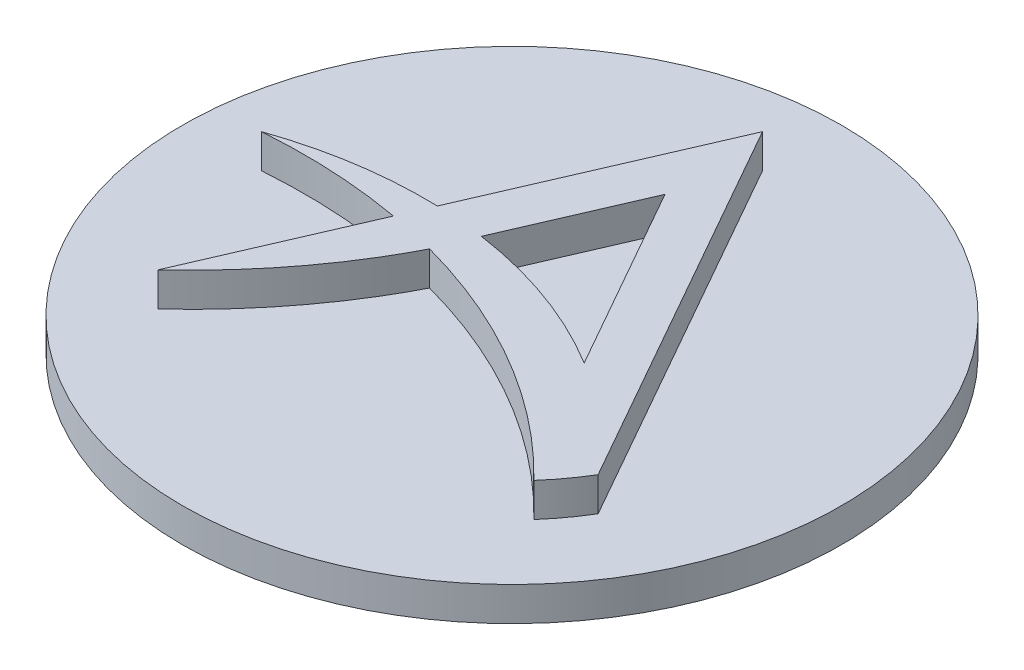
ISO-10303-21;
HEADER;
FILE_DESCRIPTION(('STEP AP214'),'2;1');
FILE_NAME('part.step','',(''),(''),'','','');
FILE_SCHEMA(('AUTOMOTIVE_DESIGN { 1 0 10303 214 1 1 1 1 }'));
ENDSEC;
DATA;
#1=APPLICATION_CONTEXT('core data for automotive mechanical design processes');
#2=APPLICATION_PROTOCOL_DEFINITION('international standard','automotive_design',2000,#1);
#3=PRODUCT_CONTEXT('',#1,'mechanical');
#4=PRODUCT('Part','Part','',(#3));
#5=PRODUCT_RELATED_PRODUCT_CATEGORY('part','',(#4));
#6=PRODUCT_DEFINITION_FORMATION('','',#4);
#7=PRODUCT_DEFINITION_CONTEXT('part definition',#1,'design');
#8=PRODUCT_DEFINITION('design','',#6,#7);
#9=PRODUCT_DEFINITION_SHAPE('','',#8);
#10=(LENGTH_UNIT() NAMED_UNIT(*) SI_UNIT(.MILLI.,.METRE.));
#11=(NAMED_UNIT(*) PLANE_ANGLE_UNIT() SI_UNIT($,.RADIAN.));
#12=(NAMED_UNIT(*) SI_UNIT($,.STERADIAN.) SOLID_ANGLE_UNIT());
#13=UNCERTAINTY_MEASURE_WITH_UNIT(LENGTH_MEASURE(1.E-05),#10,'distance_accuracy_value','');
#14=(GEOMETRIC_REPRESENTATION_CONTEXT(3) GLOBAL_UNCERTAINTY_ASSIGNED_CONTEXT((#13)) GLOBAL_UNIT_ASSIGNED_CONTEXT((#10,
#11,#12)) REPRESENTATION_CONTEXT('',''));
#15=CARTESIAN_POINT('',(0.,0.,0.));
#16=DIRECTION('',(0.,0.,1.));
#17=DIRECTION('',(1.,0.,0.));
#18=AXIS2_PLACEMENT_3D('',#15,#16,#17);
#19=CARTESIAN_POINT('',(0.,2.5,0.));
#20=DIRECTION('',(0.,-1.,0.));
#21=DIRECTION('',(0.,0.,-1.));
#22=AXIS2_PLACEMENT_3D('',#19,#20,#21);
#23=CYLINDRICAL_SURFACE('',#22,24.3);
#24=CARTESIAN_POINT('',(0.,2.5,0.));
#25=DIRECTION('',(0.,1.,0.));
#26=DIRECTION('',(0.,0.,1.));
#27=AXIS2_PLACEMENT_3D('',#24,#25,#26);
#28=CIRCLE('',#27,24.3);
#29=CARTESIAN_POINT('',(0.,2.5,24.3));
#30=VERTEX_POINT('',#29);
#31=EDGE_CURVE('E11',#30,#30,#28,.T.);
#32=ORIENTED_EDGE('',*,*,#31,.F.);
#33=EDGE_LOOP('',(#32));
#34=FACE_BOUND('',#33,.T.);
#35=CARTESIAN_POINT('',(0.,0.,0.));
#36=DIRECTION('',(0.,1.,0.));
#37=DIRECTION('',(0.,0.,1.));
#38=AXIS2_PLACEMENT_3D('',#35,#36,#37);
#39=CIRCLE('',#38,24.3);
#40=CARTESIAN_POINT('',(0.,0.,24.3));
#41=VERTEX_POINT('',#40);
#42=EDGE_CURVE('E43',#41,#41,#39,.T.);
#43=ORIENTED_EDGE('',*,*,#42,.T.);
#44=EDGE_LOOP('',(#43));
#45=FACE_BOUND('',#44,.T.);
#46=ADVANCED_FACE('F40',(#34,#45),#23,.T.);
#47=CARTESIAN_POINT('',(0.,2.5,0.));
#48=DIRECTION('',(0.,1.,0.));
#49=DIRECTION('',(0.,0.,1.));
#50=AXIS2_PLACEMENT_3D('',#47,#48,#49);
#51=PLANE('',#50);
#52=DIRECTION('',(0.397081863577859,0.,-0.91778319532313));
#53=VECTOR('',#52,1.);
#54=CARTESIAN_POINT('',(-6.73065681269044,2.5,-2.9120404076969));
#55=LINE('',#54,#53);
#56=CARTESIAN_POINT('',(-13.4613136253809,2.5,12.6446603202456));
#57=VERTEX_POINT('',#56);
#58=CARTESIAN_POINT('',(-8.21708849437097,2.5,0.523578651179607));
#59=VERTEX_POINT('',#58);
#60=EDGE_CURVE('E216',#57,#59,#55,.T.);
#61=ORIENTED_EDGE('',*,*,#60,.T.);
#62=CARTESIAN_POINT('',(-15.4090407134637,2.5,40.7164659561309));
#63=DIRECTION('',(0.,1.,0.));
#64=DIRECTION('',(0.,0.,1.));
#65=AXIS2_PLACEMENT_3D('',#62,#63,#64);
#66=CIRCLE('',#65,40.8312670221024);
#67=CARTESIAN_POINT('',(-18.4687411356394,2.5,0.));
#68=VERTEX_POINT('',#67);
#69=EDGE_CURVE('E142',#68,#59,#66,.F.);
#70=ORIENTED_EDGE('',*,*,#69,.F.);
#71=CARTESIAN_POINT('',(-8.16544651984489,2.5,29.5139268269388));
#72=DIRECTION('',(0.,1.,0.));
#73=DIRECTION('',(0.,0.,1.));
#74=AXIS2_PLACEMENT_3D('',#71,#72,#73);
#75=CIRCLE('',#74,31.2606742839267);
#76=CARTESIAN_POINT('',(-7.24074307061564,2.5,-1.73306791202355));
#77=VERTEX_POINT('',#76);
#78=EDGE_CURVE('E145',#68,#77,#75,.F.);
#79=ORIENTED_EDGE('',*,*,#78,.T.);
#80=DIRECTION('',(0.397081863577859,0.,-0.91778319532313));
#81=VECTOR('',#80,1.);
#82=CARTESIAN_POINT('',(-6.73065681269044,2.5,-2.9120404076969));
#83=LINE('',#82,#81);
#84=CARTESIAN_POINT('',(0.,2.5,-18.4687411356394));
#85=VERTEX_POINT('',#84);
#86=EDGE_CURVE('E239',#77,#85,#83,.T.);
#87=ORIENTED_EDGE('',*,*,#86,.T.);
#88=DIRECTION('',(0.492957258861656,0.,0.870053527626664));
#89=VECTOR('',#88,1.);
#90=CARTESIAN_POINT('',(7.92122833579145,2.5,-4.48803077424516));
#91=LINE('',#90,#89);
#92=CARTESIAN_POINT('',(15.8424566715829,2.5,9.49267958714904));
#93=VERTEX_POINT('',#92);
#94=EDGE_CURVE('E236',#85,#93,#91,.T.);
#95=ORIENTED_EDGE('',*,*,#94,.T.);
#96=CARTESIAN_POINT('',(0.,2.5,0.));
#97=DIRECTION('',(0.,1.,0.));
#98=DIRECTION('',(0.,0.,1.));
#99=AXIS2_PLACEMENT_3D('',#96,#97,#98);
#100=CIRCLE('',#99,18.4687411356394);
#101=CARTESIAN_POINT('',(13.8412285896734,2.5,12.2276240645379));
#102=VERTEX_POINT('',#101);
#103=EDGE_CURVE('E233',#102,#93,#100,.T.);
#104=ORIENTED_EDGE('',*,*,#103,.F.);
#105=CARTESIAN_POINT('',(-15.4090407134637,2.5,40.7164659561309));
#106=DIRECTION('',(0.,1.,0.));
#107=DIRECTION('',(0.,0.,1.));
#108=AXIS2_PLACEMENT_3D('',#105,#106,#107);
#109=CIRCLE('',#108,40.8312670221024);
#110=CARTESIAN_POINT('',(-4.78637451561878,2.5,1.29120337641698));
#111=VERTEX_POINT('',#110);
#112=EDGE_CURVE('E227',#111,#102,#109,.F.);
#113=ORIENTED_EDGE('',*,*,#112,.F.);
#114=CARTESIAN_POINT('',(-13.4613136253809,2.5,12.6446603202456));
#115=CARTESIAN_POINT('',(-8.02790284611201,2.5,7.60307610644724));
#116=CARTESIAN_POINT('',(-4.78637451561878,2.5,1.29120337641698));
#117=B_SPLINE_CURVE_WITH_KNOTS('',2,(#114,#115,#116),.UNSPECIFIED.,.F.,.F.,(3,3),(0.,
0.698779305768103),.UNSPECIFIED.);
#118=EDGE_CURVE('E223',#57,#111,#117,.T.);
#119=ORIENTED_EDGE('',*,*,#118,.F.);
#120=EDGE_LOOP('',(#61,#70,#79,#87,#95,#104,#113,#119));
#121=FACE_BOUND('',#120,.T.);
#122=ORIENTED_EDGE('',*,*,#31,.T.);
#123=EDGE_LOOP('',(#122));
#124=FACE_BOUND('',#123,.T.);
#125=ADVANCED_FACE('F186',(#121,#124),#51,.T.);
#126=CARTESIAN_POINT('',(0.,0.,0.));
#127=DIRECTION('',(0.,1.,0.));
#128=DIRECTION('',(0.,0.,1.));
#129=AXIS2_PLACEMENT_3D('',#126,#127,#128);
#130=PLANE('',#129);
#131=ORIENTED_EDGE('',*,*,#42,.F.);
#132=EDGE_LOOP('',(#131));
#133=FACE_BOUND('',#132,.T.);
#134=ADVANCED_FACE('F174',(#133),#130,.F.);
#135=CARTESIAN_POINT('',(-6.73065681269044,5.,-2.9120404076969));
#136=DIRECTION('',(-0.91778319532313,0.,-0.397081863577859));
#137=DIRECTION('',(-0.397081863577859,0.,0.91778319532313));
#138=AXIS2_PLACEMENT_3D('',#135,#136,#137);
#139=PLANE('',#138);
#140=ORIENTED_EDGE('',*,*,#60,.F.);
#141=DIRECTION('',(0.,-1.,0.));
#142=VECTOR('',#141,1.);
#143=CARTESIAN_POINT('',(-13.4613136253809,5.,12.6446603202456));
#144=LINE('',#143,#142);
#145=CARTESIAN_POINT('',(-13.4613136253809,5.,12.6446603202456));
#146=VERTEX_POINT('',#145);
#147=EDGE_CURVE('E202',#146,#57,#144,.T.);
#148=ORIENTED_EDGE('',*,*,#147,.F.);
#149=DIRECTION('',(0.397081863577859,0.,-0.91778319532313));
#150=VECTOR('',#149,1.);
#151=CARTESIAN_POINT('',(-6.73065681269044,5.,-2.9120404076969));
#152=LINE('',#151,#150);
#153=CARTESIAN_POINT('',(-8.21708849437097,5.,0.523578651179607));
#154=VERTEX_POINT('',#153);
#155=EDGE_CURVE('E149',#146,#154,#152,.T.);
#156=ORIENTED_EDGE('',*,*,#155,.T.);
#157=DIRECTION('',(0.,-1.,0.));
#158=VECTOR('',#157,1.);
#159=CARTESIAN_POINT('',(-8.21708849437097,5.,0.523578651179607));
#160=LINE('',#159,#158);
#161=EDGE_CURVE('E130',#154,#59,#160,.T.);
#162=ORIENTED_EDGE('',*,*,#161,.T.);
#163=EDGE_LOOP('',(#140,#148,#156,#162));
#164=FACE_BOUND('',#163,.T.);
#165=ADVANCED_FACE('F169',(#164),#139,.T.);
#166=CARTESIAN_POINT('',(-13.4613136253809,5.,12.6446603202456));
#167=CARTESIAN_POINT('',(-8.02790284611201,5.,7.60307610644724));
#168=CARTESIAN_POINT('',(-4.78637451561878,5.,1.29120337641698));
#169=B_SPLINE_CURVE_WITH_KNOTS('',2,(#166,#167,#168),.UNSPECIFIED.,.F.,.F.,(3,3),(0.,
0.698779305768103),.UNSPECIFIED.);
#170=DIRECTION('',(0.,-1.,0.));
#171=VECTOR('',#170,1.);
#172=SURFACE_OF_LINEAR_EXTRUSION('',#169,#171);
#173=ORIENTED_EDGE('',*,*,#118,.T.);
#174=DIRECTION('',(0.,-1.,0.));
#175=VECTOR('',#174,1.);
#176=CARTESIAN_POINT('',(-4.78637451561878,5.,1.29120337641698));
#177=LINE('',#176,#175);
#178=CARTESIAN_POINT('',(-4.78637451561878,5.,1.29120337641698));
#179=VERTEX_POINT('',#178);
#180=EDGE_CURVE('E203',#179,#111,#177,.T.);
#181=ORIENTED_EDGE('',*,*,#180,.F.);
#182=EDGE_CURVE('E152',#146,#179,#169,.T.);
#183=ORIENTED_EDGE('',*,*,#182,.F.);
#184=ORIENTED_EDGE('',*,*,#147,.T.);
#185=EDGE_LOOP('',(#173,#181,#183,#184));
#186=FACE_BOUND('',#185,.T.);
#187=ADVANCED_FACE('F164',(#186),#172,.F.);
#188=CARTESIAN_POINT('',(-15.4090407134637,5.,40.7164659561309));
#189=DIRECTION('',(0.,-1.,0.));
#190=DIRECTION('',(0.,0.,-1.));
#191=AXIS2_PLACEMENT_3D('',#188,#189,#190);
#192=CYLINDRICAL_SURFACE('',#191,40.8312670221024);
#193=ORIENTED_EDGE('',*,*,#112,.T.);
#194=DIRECTION('',(0.,-1.,0.));
#195=VECTOR('',#194,1.);
#196=CARTESIAN_POINT('',(13.8412285896734,5.,12.2276240645379));
#197=LINE('',#196,#195);
#198=CARTESIAN_POINT('',(13.8412285896734,5.,12.2276240645379));
#199=VERTEX_POINT('',#198);
#200=EDGE_CURVE('E208',#199,#102,#197,.T.);
#201=ORIENTED_EDGE('',*,*,#200,.F.);
#202=CARTESIAN_POINT('',(-15.4090407134637,5.,40.7164659561309));
#203=DIRECTION('',(0.,1.,0.));
#204=DIRECTION('',(0.,0.,1.));
#205=AXIS2_PLACEMENT_3D('',#202,#203,#204);
#206=CIRCLE('',#205,40.8312670221024);
#207=EDGE_CURVE('E158',#179,#199,#206,.F.);
#208=ORIENTED_EDGE('',*,*,#207,.F.);
#209=ORIENTED_EDGE('',*,*,#180,.T.);
#210=EDGE_LOOP('',(#193,#201,#208,#209));
#211=FACE_BOUND('',#210,.T.);
#212=ADVANCED_FACE('F168',(#211),#192,.F.);
#213=CARTESIAN_POINT('',(0.,5.,0.));
#214=DIRECTION('',(0.,-1.,0.));
#215=DIRECTION('',(0.,0.,-1.));
#216=AXIS2_PLACEMENT_3D('',#213,#214,#215);
#217=CYLINDRICAL_SURFACE('',#216,18.4687411356394);
#218=ORIENTED_EDGE('',*,*,#103,.T.);
#219=DIRECTION('',(0.,-1.,0.));
#220=VECTOR('',#219,1.);
#221=CARTESIAN_POINT('',(15.8424566715829,5.,9.49267958714904));
#222=LINE('',#221,#220);
#223=CARTESIAN_POINT('',(15.8424566715829,5.,9.49267958714904));
#224=VERTEX_POINT('',#223);
#225=EDGE_CURVE('E252',#224,#93,#222,.T.);
#226=ORIENTED_EDGE('',*,*,#225,.F.);
#227=CARTESIAN_POINT('',(0.,5.,0.));
#228=DIRECTION('',(0.,1.,0.));
#229=DIRECTION('',(0.,0.,1.));
#230=AXIS2_PLACEMENT_3D('',#227,#228,#229);
#231=CIRCLE('',#230,18.4687411356394);
#232=EDGE_CURVE('E258',#199,#224,#231,.T.);
#233=ORIENTED_EDGE('',*,*,#232,.F.);
#234=ORIENTED_EDGE('',*,*,#200,.T.);
#235=EDGE_LOOP('',(#218,#226,#233,#234));
#236=FACE_BOUND('',#235,.T.);
#237=ADVANCED_FACE('F255',(#236),#217,.T.);
#238=CARTESIAN_POINT('',(7.92122833579145,5.,-4.48803077424516));
#239=DIRECTION('',(0.870053527626664,0.,-0.492957258861656));
#240=DIRECTION('',(-0.492957258861656,0.,-0.870053527626664));
#241=AXIS2_PLACEMENT_3D('',#238,#239,#240);
#242=PLANE('',#241);
#243=ORIENTED_EDGE('',*,*,#94,.F.);
#244=DIRECTION('',(0.,-1.,0.));
#245=VECTOR('',#244,1.);
#246=CARTESIAN_POINT('',(0.,5.,-18.4687411356394));
#247=LINE('',#246,#245);
#248=CARTESIAN_POINT('',(0.,5.,-18.4687411356394));
#249=VERTEX_POINT('',#248);
#250=EDGE_CURVE('E250',#249,#85,#247,.T.);
#251=ORIENTED_EDGE('',*,*,#250,.F.);
#252=DIRECTION('',(0.492957258861656,0.,0.870053527626664));
#253=VECTOR('',#252,1.);
#254=CARTESIAN_POINT('',(7.92122833579145,5.,-4.48803077424516));
#255=LINE('',#254,#253);
#256=EDGE_CURVE('E271',#249,#224,#255,.T.);
#257=ORIENTED_EDGE('',*,*,#256,.T.);
#258=ORIENTED_EDGE('',*,*,#225,.T.);
#259=EDGE_LOOP('',(#243,#251,#257,#258));
#260=FACE_BOUND('',#259,.T.);
#261=ADVANCED_FACE('F268',(#260),#242,.T.);
#262=CARTESIAN_POINT('',(-6.73065681269044,5.,-2.9120404076969));
#263=DIRECTION('',(-0.91778319532313,0.,-0.397081863577859));
#264=DIRECTION('',(-0.397081863577859,0.,0.91778319532313));
#265=AXIS2_PLACEMENT_3D('',#262,#263,#264);
#266=PLANE('',#265);
#267=ORIENTED_EDGE('',*,*,#86,.F.);
#268=DIRECTION('',(0.,-1.,0.));
#269=VECTOR('',#268,1.);
#270=CARTESIAN_POINT('',(-7.24074307061564,5.,-1.73306791202355));
#271=LINE('',#270,#269);
#272=CARTESIAN_POINT('',(-7.24074307061564,5.,-1.73306791202355));
#273=VERTEX_POINT('',#272);
#274=EDGE_CURVE('E248',#273,#77,#271,.T.);
#275=ORIENTED_EDGE('',*,*,#274,.F.);
#276=DIRECTION('',(0.397081863577859,0.,-0.91778319532313));
#277=VECTOR('',#276,1.);
#278=CARTESIAN_POINT('',(-6.73065681269044,5.,-2.9120404076969));
#279=LINE('',#278,#277);
#280=EDGE_CURVE('E274',#273,#249,#279,.T.);
#281=ORIENTED_EDGE('',*,*,#280,.T.);
#282=ORIENTED_EDGE('',*,*,#250,.T.);
#283=EDGE_LOOP('',(#267,#275,#281,#282));
#284=FACE_BOUND('',#283,.T.);
#285=ADVANCED_FACE('F288',(#284),#266,.T.);
#286=CARTESIAN_POINT('',(-8.16544651984489,5.,29.5139268269388));
#287=DIRECTION('',(0.,-1.,0.));
#288=DIRECTION('',(0.,0.,-1.));
#289=AXIS2_PLACEMENT_3D('',#286,#287,#288);
#290=CYLINDRICAL_SURFACE('',#289,31.2606742839267);
#291=ORIENTED_EDGE('',*,*,#78,.F.);
#292=DIRECTION('',(0.,-1.,0.));
#293=VECTOR('',#292,1.);
#294=CARTESIAN_POINT('',(-18.4687411356394,5.,0.));
#295=LINE('',#294,#293);
#296=CARTESIAN_POINT('',(-18.4687411356394,5.,0.));
#297=VERTEX_POINT('',#296);
#298=EDGE_CURVE('E245',#297,#68,#295,.T.);
#299=ORIENTED_EDGE('',*,*,#298,.F.);
#300=CARTESIAN_POINT('',(-8.16544651984489,5.,29.5139268269388));
#301=DIRECTION('',(0.,1.,0.));
#302=DIRECTION('',(0.,0.,1.));
#303=AXIS2_PLACEMENT_3D('',#300,#301,#302);
#304=CIRCLE('',#303,31.2606742839267);
#305=EDGE_CURVE('E276',#297,#273,#304,.F.);
#306=ORIENTED_EDGE('',*,*,#305,.T.);
#307=ORIENTED_EDGE('',*,*,#274,.T.);
#308=EDGE_LOOP('',(#291,#299,#306,#307));
#309=FACE_BOUND('',#308,.T.);
#310=ADVANCED_FACE('F185',(#309),#290,.T.);
#311=CARTESIAN_POINT('',(-8.16544651984489,5.,29.5139268269388));
#312=DIRECTION('',(0.,-1.,0.));
#313=DIRECTION('',(0.,0.,-1.));
#314=AXIS2_PLACEMENT_3D('',#311,#312,#313);
#315=CYLINDRICAL_SURFACE('',#314,31.2606742839267);
#316=CARTESIAN_POINT('',(-8.16544651984489,2.5,29.5139268269388));
#317=DIRECTION('',(0.,1.,0.));
#318=DIRECTION('',(0.,0.,1.));
#319=AXIS2_PLACEMENT_3D('',#316,#317,#318);
#320=CIRCLE('',#319,31.2606742839267);
#321=CARTESIAN_POINT('',(-3.68102820270832,2.5,-1.42342517743752));
#322=VERTEX_POINT('',#321);
#323=CARTESIAN_POINT('',(8.19867085549764,2.5,2.87851019397114));
#324=VERTEX_POINT('',#323);
#325=EDGE_CURVE('E128',#322,#324,#320,.F.);
#326=ORIENTED_EDGE('',*,*,#325,.F.);
#327=DIRECTION('',(0.,-1.,0.));
#328=VECTOR('',#327,1.);
#329=CARTESIAN_POINT('',(-3.68102820270832,5.,-1.42342517743752));
#330=LINE('',#329,#328);
#331=CARTESIAN_POINT('',(-3.68102820270832,5.,-1.42342517743752));
#332=VERTEX_POINT('',#331);
#333=EDGE_CURVE('E121',#332,#322,#330,.T.);
#334=ORIENTED_EDGE('',*,*,#333,.F.);
#335=CARTESIAN_POINT('',(-8.16544651984489,5.,29.5139268269388));
#336=DIRECTION('',(0.,1.,0.));
#337=DIRECTION('',(0.,0.,1.));
#338=AXIS2_PLACEMENT_3D('',#335,#336,#337);
#339=CIRCLE('',#338,31.2606742839267);
#340=CARTESIAN_POINT('',(8.19867085549764,5.,2.87851019397114));
#341=VERTEX_POINT('',#340);
#342=EDGE_CURVE('E126',#332,#341,#339,.F.);
#343=ORIENTED_EDGE('',*,*,#342,.T.);
#344=DIRECTION('',(0.,-1.,0.));
#345=VECTOR('',#344,1.);
#346=CARTESIAN_POINT('',(8.19867085549764,5.,2.87851019397114));
#347=LINE('',#346,#345);
#348=EDGE_CURVE('E212',#341,#324,#347,.T.);
#349=ORIENTED_EDGE('',*,*,#348,.T.);
#350=EDGE_LOOP('',(#326,#334,#343,#349));
#351=FACE_BOUND('',#350,.T.);
#352=ADVANCED_FACE('F123',(#351),#315,.T.);
#353=CARTESIAN_POINT('',(-3.61937178054503,5.,-1.56593289016796));
#354=DIRECTION('',(-0.91778319532313,0.,-0.397081863577859));
#355=DIRECTION('',(-0.397081863577859,0.,0.91778319532313));
#356=AXIS2_PLACEMENT_3D('',#353,#354,#355);
#357=PLANE('',#356);
#358=DIRECTION('',(0.397081863577859,0.,-0.91778319532313));
#359=VECTOR('',#358,1.);
#360=CARTESIAN_POINT('',(-3.61937178054503,2.5,-1.56593289016796));
#361=LINE('',#360,#359);
#362=CARTESIAN_POINT('',(0.407335967209138,2.5,-10.8729424575833));
#363=VERTEX_POINT('',#362);
#364=EDGE_CURVE('E54',#322,#363,#361,.T.);
#365=ORIENTED_EDGE('',*,*,#364,.T.);
#366=DIRECTION('',(0.,-1.,0.));
#367=VECTOR('',#366,1.);
#368=CARTESIAN_POINT('',(0.407335967209139,5.,-10.8729424575833));
#369=LINE('',#368,#367);
#370=CARTESIAN_POINT('',(0.407335967209139,5.,-10.8729424575833));
#371=VERTEX_POINT('',#370);
#372=EDGE_CURVE('E131',#371,#363,#369,.T.);
#373=ORIENTED_EDGE('',*,*,#372,.F.);
#374=DIRECTION('',(0.397081863577859,0.,-0.91778319532313));
#375=VECTOR('',#374,1.);
#376=CARTESIAN_POINT('',(-3.61937178054503,5.,-1.56593289016796));
#377=LINE('',#376,#375);
#378=EDGE_CURVE('E134',#332,#371,#377,.T.);
#379=ORIENTED_EDGE('',*,*,#378,.F.);
#380=ORIENTED_EDGE('',*,*,#333,.T.);
#381=EDGE_LOOP('',(#365,#373,#379,#380));
#382=FACE_BOUND('',#381,.T.);
#383=ADVANCED_FACE('F135',(#382),#357,.F.);
#384=CARTESIAN_POINT('',(4.97174687713706,5.,-2.81690566670415));
#385=DIRECTION('',(-0.870053527626664,0.,0.492957258861656));
#386=DIRECTION('',(0.492957258861656,0.,0.870053527626664));
#387=AXIS2_PLACEMENT_3D('',#384,#385,#386);
#388=PLANE('',#387);
#389=DIRECTION('',(-0.492957258861656,0.,-0.870053527626664));
#390=VECTOR('',#389,1.);
#391=CARTESIAN_POINT('',(4.97174687713706,2.5,-2.81690566670415));
#392=LINE('',#391,#390);
#393=EDGE_CURVE('E58',#324,#363,#392,.T.);
#394=ORIENTED_EDGE('',*,*,#393,.F.);
#395=ORIENTED_EDGE('',*,*,#348,.F.);
#396=DIRECTION('',(-0.492957258861656,0.,-0.870053527626664));
#397=VECTOR('',#396,1.);
#398=CARTESIAN_POINT('',(4.97174687713706,5.,-2.81690566670415));
#399=LINE('',#398,#397);
#400=EDGE_CURVE('E138',#341,#371,#399,.T.);
#401=ORIENTED_EDGE('',*,*,#400,.T.);
#402=ORIENTED_EDGE('',*,*,#372,.T.);
#403=EDGE_LOOP('',(#394,#395,#401,#402));
#404=FACE_BOUND('',#403,.T.);
#405=ADVANCED_FACE('F176',(#404),#388,.T.);
#406=CARTESIAN_POINT('',(-15.4090407134637,5.,40.7164659561309));
#407=DIRECTION('',(0.,-1.,0.));
#408=DIRECTION('',(0.,0.,-1.));
#409=AXIS2_PLACEMENT_3D('',#406,#407,#408);
#410=CYLINDRICAL_SURFACE('',#409,40.8312670221024);
#411=ORIENTED_EDGE('',*,*,#69,.T.);
#412=ORIENTED_EDGE('',*,*,#161,.F.);
#413=CARTESIAN_POINT('',(-15.4090407134637,5.,40.7164659561309));
#414=DIRECTION('',(0.,1.,0.));
#415=DIRECTION('',(0.,0.,1.));
#416=AXIS2_PLACEMENT_3D('',#413,#414,#415);
#417=CIRCLE('',#416,40.8312670221024);
#418=EDGE_CURVE('E214',#297,#154,#417,.F.);
#419=ORIENTED_EDGE('',*,*,#418,.F.);
#420=ORIENTED_EDGE('',*,*,#298,.T.);
#421=EDGE_LOOP('',(#411,#412,#419,#420));
#422=FACE_BOUND('',#421,.T.);
#423=ADVANCED_FACE('F179',(#422),#410,.F.);
#424=CARTESIAN_POINT('',(0.,5.,0.));
#425=DIRECTION('',(0.,1.,0.));
#426=DIRECTION('',(0.,0.,1.));
#427=AXIS2_PLACEMENT_3D('',#424,#425,#426);
#428=PLANE('',#427);
#429=ORIENTED_EDGE('',*,*,#342,.F.);
#430=ORIENTED_EDGE('',*,*,#378,.T.);
#431=ORIENTED_EDGE('',*,*,#400,.F.);
#432=EDGE_LOOP('',(#429,#430,#431));
#433=FACE_BOUND('',#432,.T.);
#434=ORIENTED_EDGE('',*,*,#155,.F.);
#435=ORIENTED_EDGE('',*,*,#182,.T.);
#436=ORIENTED_EDGE('',*,*,#207,.T.);
#437=ORIENTED_EDGE('',*,*,#232,.T.);
#438=ORIENTED_EDGE('',*,*,#256,.F.);
#439=ORIENTED_EDGE('',*,*,#280,.F.);
#440=ORIENTED_EDGE('',*,*,#305,.F.);
#441=ORIENTED_EDGE('',*,*,#418,.T.);
#442=EDGE_LOOP('',(#434,#435,#436,#437,#438,#439,#440,#441));
#443=FACE_BOUND('',#442,.T.);
#444=ADVANCED_FACE('F140',(#433,#443),#428,.T.);
#445=ORIENTED_EDGE('',*,*,#325,.T.);
#446=ORIENTED_EDGE('',*,*,#393,.T.);
#447=ORIENTED_EDGE('',*,*,#364,.F.);
#448=EDGE_LOOP('',(#445,#446,#447));
#449=FACE_BOUND('',#448,.T.);
#450=ADVANCED_FACE('F189',(#449),#51,.T.);
#451=CLOSED_SHELL('',(#46,#125,#134,#165,#187,#212,#237,#261,#285,#310,#352,#383,#405,#423,#444,#450));
#452=MANIFOLD_SOLID_BREP('B2',#451);
#453=ADVANCED_BREP_SHAPE_REPRESENTATION('',(#18,#452),#14);
#454=SHAPE_DEFINITION_REPRESENTATION(#9,#453);
ENDSEC;
END-ISO-10303-21;
